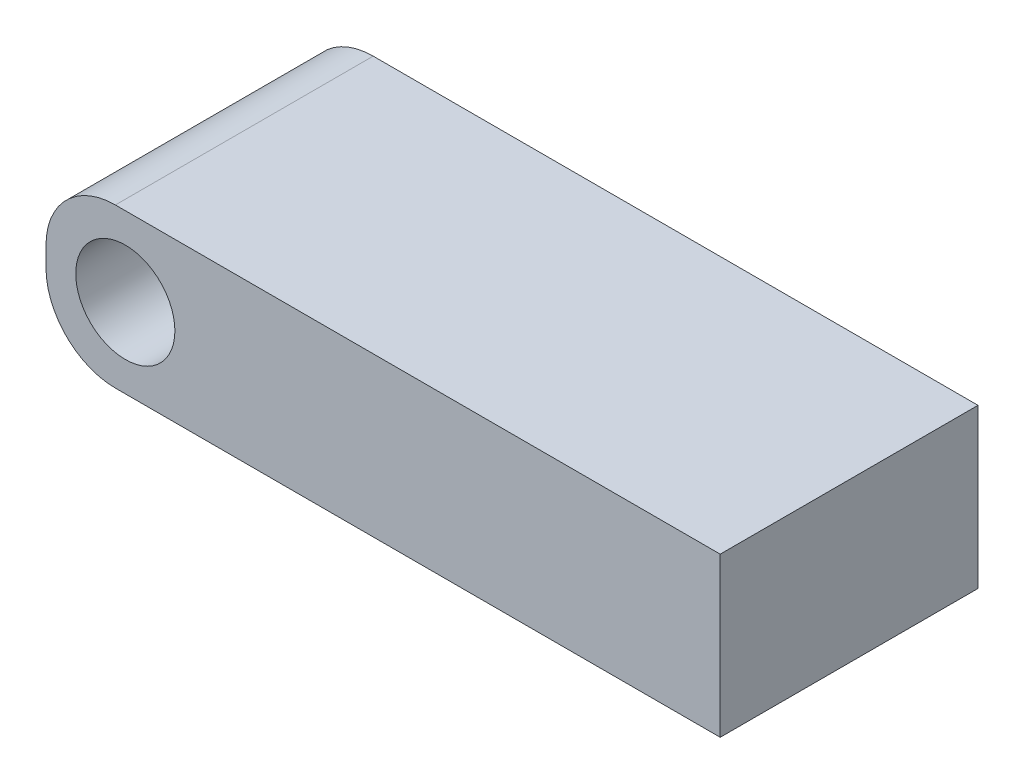
ISO-10303-21;
HEADER;
FILE_DESCRIPTION(('STEP AP214'),'2;1');
FILE_NAME('part.step','',(''),(''),'','','');
FILE_SCHEMA(('AUTOMOTIVE_DESIGN { 1 0 10303 214 1 1 1 1 }'));
ENDSEC;
DATA;
#1=APPLICATION_CONTEXT('core data for automotive mechanical design processes');
#2=APPLICATION_PROTOCOL_DEFINITION('international standard','automotive_design',2000,#1);
#3=PRODUCT_CONTEXT('',#1,'mechanical');
#4=PRODUCT('Part','Part','',(#3));
#5=PRODUCT_RELATED_PRODUCT_CATEGORY('part','',(#4));
#6=PRODUCT_DEFINITION_FORMATION('','',#4);
#7=PRODUCT_DEFINITION_CONTEXT('part definition',#1,'design');
#8=PRODUCT_DEFINITION('design','',#6,#7);
#9=PRODUCT_DEFINITION_SHAPE('','',#8);
#10=(LENGTH_UNIT() NAMED_UNIT(*) SI_UNIT(.MILLI.,.METRE.));
#11=(NAMED_UNIT(*) PLANE_ANGLE_UNIT() SI_UNIT($,.RADIAN.));
#12=(NAMED_UNIT(*) SI_UNIT($,.STERADIAN.) SOLID_ANGLE_UNIT());
#13=UNCERTAINTY_MEASURE_WITH_UNIT(LENGTH_MEASURE(1.E-05),#10,'distance_accuracy_value','');
#14=(GEOMETRIC_REPRESENTATION_CONTEXT(3) GLOBAL_UNCERTAINTY_ASSIGNED_CONTEXT((#13)) GLOBAL_UNIT_ASSIGNED_CONTEXT((#10,
#11,#12)) REPRESENTATION_CONTEXT('',''));
#15=CARTESIAN_POINT('',(0.,0.,0.));
#16=DIRECTION('',(0.,0.,1.));
#17=DIRECTION('',(1.,0.,0.));
#18=AXIS2_PLACEMENT_3D('',#15,#16,#17);
#19=CARTESIAN_POINT('',(-19.5,30.9286384577808,6.5));
#20=DIRECTION('',(0.,0.,-1.));
#21=DIRECTION('',(-1.,0.,0.));
#22=AXIS2_PLACEMENT_3D('',#19,#20,#21);
#23=PLANE('',#22);
#24=CARTESIAN_POINT('',(-19.5,30.9286384577808,6.5));
#25=DIRECTION('',(0.,0.,-1.));
#26=DIRECTION('',(-1.,0.,0.));
#27=AXIS2_PLACEMENT_3D('',#24,#25,#26);
#28=CIRCLE('',#27,3.5);
#29=CARTESIAN_POINT('',(-23.,30.9286384577807,6.5));
#30=VERTEX_POINT('',#29);
#31=CARTESIAN_POINT('',(-19.5,34.4286384577808,6.5));
#32=VERTEX_POINT('',#31);
#33=EDGE_CURVE('E177',#30,#32,#28,.T.);
#34=ORIENTED_EDGE('',*,*,#33,.F.);
#35=DIRECTION('',(0.,-1.,0.));
#36=VECTOR('',#35,1.);
#37=CARTESIAN_POINT('',(-23.,30.9286384577807,6.5));
#38=LINE('',#37,#36);
#39=CARTESIAN_POINT('',(-23.,29.9286384577808,6.5));
#40=VERTEX_POINT('',#39);
#41=EDGE_CURVE('E131',#30,#40,#38,.T.);
#42=ORIENTED_EDGE('',*,*,#41,.T.);
#43=CARTESIAN_POINT('',(-19.5,29.9286384577807,6.5));
#44=DIRECTION('',(0.,0.,1.));
#45=DIRECTION('',(1.,0.,0.));
#46=AXIS2_PLACEMENT_3D('',#43,#44,#45);
#47=CIRCLE('',#46,3.5);
#48=CARTESIAN_POINT('',(-19.5,26.4286384577808,6.5));
#49=VERTEX_POINT('',#48);
#50=EDGE_CURVE('E123',#40,#49,#47,.T.);
#51=ORIENTED_EDGE('',*,*,#50,.T.);
#52=DIRECTION('',(1.,0.,0.));
#53=VECTOR('',#52,1.);
#54=CARTESIAN_POINT('',(-19.5,26.4286384577808,6.5));
#55=LINE('',#54,#53);
#56=CARTESIAN_POINT('',(11.,26.4286384577808,6.5));
#57=VERTEX_POINT('',#56);
#58=EDGE_CURVE('E129',#49,#57,#55,.T.);
#59=ORIENTED_EDGE('',*,*,#58,.T.);
#60=DIRECTION('',(0.,-1.,0.));
#61=VECTOR('',#60,1.);
#62=CARTESIAN_POINT('',(11.,34.4286384577808,6.5));
#63=LINE('',#62,#61);
#64=CARTESIAN_POINT('',(11.,34.4286384577808,6.5));
#65=VERTEX_POINT('',#64);
#66=EDGE_CURVE('E149',#65,#57,#63,.T.);
#67=ORIENTED_EDGE('',*,*,#66,.F.);
#68=DIRECTION('',(1.,0.,0.));
#69=VECTOR('',#68,1.);
#70=CARTESIAN_POINT('',(-19.5,34.4286384577808,6.5));
#71=LINE('',#70,#69);
#72=EDGE_CURVE('E152',#32,#65,#71,.T.);
#73=ORIENTED_EDGE('',*,*,#72,.F.);
#74=EDGE_LOOP('',(#34,#42,#51,#59,#67,#73));
#75=FACE_BOUND('',#74,.T.);
#76=CARTESIAN_POINT('',(-19.,30.4286384577808,6.5));
#77=DIRECTION('',(0.,0.,1.));
#78=DIRECTION('',(1.,0.,0.));
#79=AXIS2_PLACEMENT_3D('',#76,#77,#78);
#80=CIRCLE('',#79,2.5);
#81=CARTESIAN_POINT('',(-16.5,30.4286384577808,6.5));
#82=VERTEX_POINT('',#81);
#83=EDGE_CURVE('E163',#82,#82,#80,.T.);
#84=ORIENTED_EDGE('',*,*,#83,.F.);
#85=EDGE_LOOP('',(#84));
#86=FACE_BOUND('',#85,.T.);
#87=ADVANCED_FACE('F64',(#75,#86),#23,.F.);
#88=CARTESIAN_POINT('',(-19.5,30.9286384577808,-6.5));
#89=DIRECTION('',(0.,0.,-1.));
#90=DIRECTION('',(-1.,0.,0.));
#91=AXIS2_PLACEMENT_3D('',#88,#89,#90);
#92=PLANE('',#91);
#93=CARTESIAN_POINT('',(-19.5,30.9286384577808,-6.5));
#94=DIRECTION('',(0.,0.,-1.));
#95=DIRECTION('',(-1.,0.,0.));
#96=AXIS2_PLACEMENT_3D('',#93,#94,#95);
#97=CIRCLE('',#96,3.5);
#98=CARTESIAN_POINT('',(-23.,30.9286384577807,-6.5));
#99=VERTEX_POINT('',#98);
#100=CARTESIAN_POINT('',(-19.5,34.4286384577808,-6.5));
#101=VERTEX_POINT('',#100);
#102=EDGE_CURVE('E158',#99,#101,#97,.T.);
#103=ORIENTED_EDGE('',*,*,#102,.T.);
#104=DIRECTION('',(1.,0.,0.));
#105=VECTOR('',#104,1.);
#106=CARTESIAN_POINT('',(-19.5,34.4286384577808,-6.5));
#107=LINE('',#106,#105);
#108=CARTESIAN_POINT('',(11.,34.4286384577808,-6.5));
#109=VERTEX_POINT('',#108);
#110=EDGE_CURVE('E162',#101,#109,#107,.T.);
#111=ORIENTED_EDGE('',*,*,#110,.T.);
#112=DIRECTION('',(0.,-1.,0.));
#113=VECTOR('',#112,1.);
#114=CARTESIAN_POINT('',(11.,34.4286384577808,-6.5));
#115=LINE('',#114,#113);
#116=CARTESIAN_POINT('',(11.,26.4286384577808,-6.5));
#117=VERTEX_POINT('',#116);
#118=EDGE_CURVE('E167',#109,#117,#115,.T.);
#119=ORIENTED_EDGE('',*,*,#118,.T.);
#120=DIRECTION('',(1.,0.,0.));
#121=VECTOR('',#120,1.);
#122=CARTESIAN_POINT('',(-19.5,26.4286384577808,-6.5));
#123=LINE('',#122,#121);
#124=CARTESIAN_POINT('',(-19.5,26.4286384577808,-6.5));
#125=VERTEX_POINT('',#124);
#126=EDGE_CURVE('E171',#125,#117,#123,.T.);
#127=ORIENTED_EDGE('',*,*,#126,.F.);
#128=CARTESIAN_POINT('',(-19.5,29.9286384577807,-6.5));
#129=DIRECTION('',(0.,0.,1.));
#130=DIRECTION('',(1.,0.,0.));
#131=AXIS2_PLACEMENT_3D('',#128,#129,#130);
#132=CIRCLE('',#131,3.5);
#133=CARTESIAN_POINT('',(-23.,29.9286384577808,-6.5));
#134=VERTEX_POINT('',#133);
#135=EDGE_CURVE('E139',#134,#125,#132,.T.);
#136=ORIENTED_EDGE('',*,*,#135,.F.);
#137=DIRECTION('',(0.,-1.,0.));
#138=VECTOR('',#137,1.);
#139=CARTESIAN_POINT('',(-23.,30.9286384577807,-6.5));
#140=LINE('',#139,#138);
#141=EDGE_CURVE('E105',#99,#134,#140,.T.);
#142=ORIENTED_EDGE('',*,*,#141,.F.);
#143=EDGE_LOOP('',(#103,#111,#119,#127,#136,#142));
#144=FACE_BOUND('',#143,.T.);
#145=CARTESIAN_POINT('',(-19.,30.4286384577808,-6.5));
#146=DIRECTION('',(0.,0.,1.));
#147=DIRECTION('',(1.,0.,0.));
#148=AXIS2_PLACEMENT_3D('',#145,#146,#147);
#149=CIRCLE('',#148,2.5);
#150=CARTESIAN_POINT('',(-16.5,30.4286384577808,-6.5));
#151=VERTEX_POINT('',#150);
#152=EDGE_CURVE('E196',#151,#151,#149,.T.);
#153=ORIENTED_EDGE('',*,*,#152,.T.);
#154=EDGE_LOOP('',(#153));
#155=FACE_BOUND('',#154,.T.);
#156=ADVANCED_FACE('F188',(#144,#155),#92,.T.);
#157=CARTESIAN_POINT('',(-19.5,30.9286384577808,6.5));
#158=DIRECTION('',(0.,0.,-1.));
#159=DIRECTION('',(-1.,0.,0.));
#160=AXIS2_PLACEMENT_3D('',#157,#158,#159);
#161=CYLINDRICAL_SURFACE('',#160,3.5);
#162=ORIENTED_EDGE('',*,*,#102,.F.);
#163=DIRECTION('',(0.,0.,-1.));
#164=VECTOR('',#163,1.);
#165=CARTESIAN_POINT('',(-23.,30.9286384577807,6.5));
#166=LINE('',#165,#164);
#167=EDGE_CURVE('E12',#30,#99,#166,.T.);
#168=ORIENTED_EDGE('',*,*,#167,.F.);
#169=ORIENTED_EDGE('',*,*,#33,.T.);
#170=DIRECTION('',(0.,0.,-1.));
#171=VECTOR('',#170,1.);
#172=CARTESIAN_POINT('',(-19.5,34.4286384577808,6.5));
#173=LINE('',#172,#171);
#174=EDGE_CURVE('E68',#32,#101,#173,.T.);
#175=ORIENTED_EDGE('',*,*,#174,.T.);
#176=EDGE_LOOP('',(#162,#168,#169,#175));
#177=FACE_BOUND('',#176,.T.);
#178=ADVANCED_FACE('F66',(#177),#161,.T.);
#179=CARTESIAN_POINT('',(-23.,30.9286384577807,6.5));
#180=DIRECTION('',(1.,0.,0.));
#181=DIRECTION('',(0.,0.,-1.));
#182=AXIS2_PLACEMENT_3D('',#179,#180,#181);
#183=PLANE('',#182);
#184=ORIENTED_EDGE('',*,*,#141,.T.);
#185=DIRECTION('',(0.,0.,-1.));
#186=VECTOR('',#185,1.);
#187=CARTESIAN_POINT('',(-23.,29.9286384577808,6.5));
#188=LINE('',#187,#186);
#189=EDGE_CURVE('E75',#40,#134,#188,.T.);
#190=ORIENTED_EDGE('',*,*,#189,.F.);
#191=ORIENTED_EDGE('',*,*,#41,.F.);
#192=ORIENTED_EDGE('',*,*,#167,.T.);
#193=EDGE_LOOP('',(#184,#190,#191,#192));
#194=FACE_BOUND('',#193,.T.);
#195=ADVANCED_FACE('F214',(#194),#183,.F.);
#196=CARTESIAN_POINT('',(-19.5,29.9286384577807,6.5));
#197=DIRECTION('',(0.,0.,-1.));
#198=DIRECTION('',(-1.,0.,0.));
#199=AXIS2_PLACEMENT_3D('',#196,#197,#198);
#200=CYLINDRICAL_SURFACE('',#199,3.5);
#201=ORIENTED_EDGE('',*,*,#135,.T.);
#202=DIRECTION('',(0.,0.,-1.));
#203=VECTOR('',#202,1.);
#204=CARTESIAN_POINT('',(-19.5,26.4286384577808,6.5));
#205=LINE('',#204,#203);
#206=EDGE_CURVE('E136',#49,#125,#205,.T.);
#207=ORIENTED_EDGE('',*,*,#206,.F.);
#208=ORIENTED_EDGE('',*,*,#50,.F.);
#209=ORIENTED_EDGE('',*,*,#189,.T.);
#210=EDGE_LOOP('',(#201,#207,#208,#209));
#211=FACE_BOUND('',#210,.T.);
#212=ADVANCED_FACE('F137',(#211),#200,.T.);
#213=CARTESIAN_POINT('',(-19.5,26.4286384577808,6.5));
#214=DIRECTION('',(0.,1.,0.));
#215=DIRECTION('',(0.,0.,1.));
#216=AXIS2_PLACEMENT_3D('',#213,#214,#215);
#217=PLANE('',#216);
#218=ORIENTED_EDGE('',*,*,#126,.T.);
#219=DIRECTION('',(0.,0.,-1.));
#220=VECTOR('',#219,1.);
#221=CARTESIAN_POINT('',(11.,26.4286384577808,6.5));
#222=LINE('',#221,#220);
#223=EDGE_CURVE('E144',#57,#117,#222,.T.);
#224=ORIENTED_EDGE('',*,*,#223,.F.);
#225=ORIENTED_EDGE('',*,*,#58,.F.);
#226=ORIENTED_EDGE('',*,*,#206,.T.);
#227=EDGE_LOOP('',(#218,#224,#225,#226));
#228=FACE_BOUND('',#227,.T.);
#229=ADVANCED_FACE('F146',(#228),#217,.F.);
#230=CARTESIAN_POINT('',(11.,34.4286384577808,6.5));
#231=DIRECTION('',(1.,0.,0.));
#232=DIRECTION('',(0.,1.,0.));
#233=AXIS2_PLACEMENT_3D('',#230,#231,#232);
#234=PLANE('',#233);
#235=ORIENTED_EDGE('',*,*,#118,.F.);
#236=DIRECTION('',(0.,0.,-1.));
#237=VECTOR('',#236,1.);
#238=CARTESIAN_POINT('',(11.,34.4286384577808,6.5));
#239=LINE('',#238,#237);
#240=EDGE_CURVE('E182',#65,#109,#239,.T.);
#241=ORIENTED_EDGE('',*,*,#240,.F.);
#242=ORIENTED_EDGE('',*,*,#66,.T.);
#243=ORIENTED_EDGE('',*,*,#223,.T.);
#244=EDGE_LOOP('',(#235,#241,#242,#243));
#245=FACE_BOUND('',#244,.T.);
#246=ADVANCED_FACE('F191',(#245),#234,.T.);
#247=CARTESIAN_POINT('',(-19.5,34.4286384577808,6.5));
#248=DIRECTION('',(0.,1.,0.));
#249=DIRECTION('',(0.,0.,1.));
#250=AXIS2_PLACEMENT_3D('',#247,#248,#249);
#251=PLANE('',#250);
#252=ORIENTED_EDGE('',*,*,#110,.F.);
#253=ORIENTED_EDGE('',*,*,#174,.F.);
#254=ORIENTED_EDGE('',*,*,#72,.T.);
#255=ORIENTED_EDGE('',*,*,#240,.T.);
#256=EDGE_LOOP('',(#252,#253,#254,#255));
#257=FACE_BOUND('',#256,.T.);
#258=ADVANCED_FACE('F186',(#257),#251,.T.);
#259=CARTESIAN_POINT('',(-19.,30.4286384577808,6.5));
#260=DIRECTION('',(0.,0.,-1.));
#261=DIRECTION('',(-1.,0.,0.));
#262=AXIS2_PLACEMENT_3D('',#259,#260,#261);
#263=CYLINDRICAL_SURFACE('',#262,2.5);
#264=ORIENTED_EDGE('',*,*,#83,.T.);
#265=EDGE_LOOP('',(#264));
#266=FACE_BOUND('',#265,.T.);
#267=ORIENTED_EDGE('',*,*,#152,.F.);
#268=EDGE_LOOP('',(#267));
#269=FACE_BOUND('',#268,.T.);
#270=ADVANCED_FACE('F204',(#266,#269),#263,.F.);
#271=CLOSED_SHELL('',(#87,#156,#178,#195,#212,#229,#246,#258,#270));
#272=MANIFOLD_SOLID_BREP('B2',#271);
#273=ADVANCED_BREP_SHAPE_REPRESENTATION('',(#18,#272),#14);
#274=SHAPE_DEFINITION_REPRESENTATION(#9,#273);
ENDSEC;
END-ISO-10303-21;
